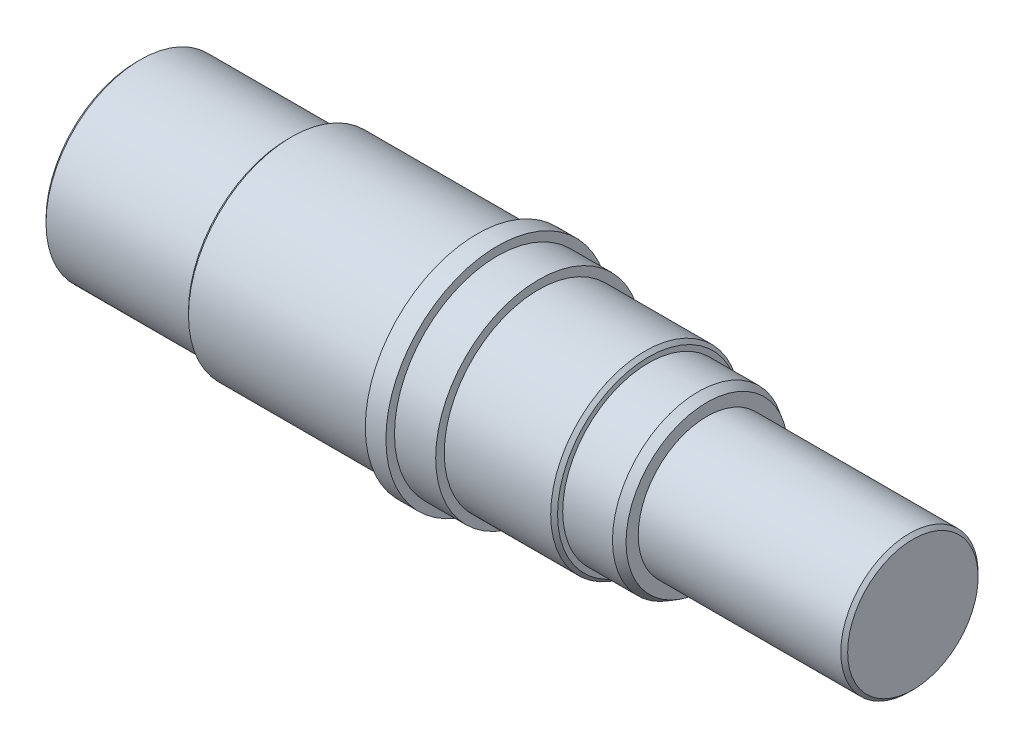
ISO-10303-21;
HEADER;
FILE_DESCRIPTION(('STEP AP214'),'2;1');
FILE_NAME('part.step','',(''),(''),'','','');
FILE_SCHEMA(('AUTOMOTIVE_DESIGN { 1 0 10303 214 1 1 1 1 }'));
ENDSEC;
DATA;
#1=APPLICATION_CONTEXT('core data for automotive mechanical design processes');
#2=APPLICATION_PROTOCOL_DEFINITION('international standard','automotive_design',2000,#1);
#3=PRODUCT_CONTEXT('',#1,'mechanical');
#4=PRODUCT('Part','Part','',(#3));
#5=PRODUCT_RELATED_PRODUCT_CATEGORY('part','',(#4));
#6=PRODUCT_DEFINITION_FORMATION('','',#4);
#7=PRODUCT_DEFINITION_CONTEXT('part definition',#1,'design');
#8=PRODUCT_DEFINITION('design','',#6,#7);
#9=PRODUCT_DEFINITION_SHAPE('','',#8);
#10=(LENGTH_UNIT() NAMED_UNIT(*) SI_UNIT(.MILLI.,.METRE.));
#11=(NAMED_UNIT(*) PLANE_ANGLE_UNIT() SI_UNIT($,.RADIAN.));
#12=(NAMED_UNIT(*) SI_UNIT($,.STERADIAN.) SOLID_ANGLE_UNIT());
#13=UNCERTAINTY_MEASURE_WITH_UNIT(LENGTH_MEASURE(1.E-05),#10,'distance_accuracy_value','');
#14=(GEOMETRIC_REPRESENTATION_CONTEXT(3) GLOBAL_UNCERTAINTY_ASSIGNED_CONTEXT((#13)) GLOBAL_UNIT_ASSIGNED_CONTEXT((#10,
#11,#12)) REPRESENTATION_CONTEXT('',''));
#15=CARTESIAN_POINT('',(0.,0.,0.));
#16=DIRECTION('',(0.,0.,1.));
#17=DIRECTION('',(1.,0.,0.));
#18=AXIS2_PLACEMENT_3D('',#15,#16,#17);
#19=CARTESIAN_POINT('',(168.152402441547,0.,0.));
#20=DIRECTION('',(1.,0.,0.));
#21=DIRECTION('',(0.,0.,-1.));
#22=AXIS2_PLACEMENT_3D('',#19,#20,#21);
#23=PLANE('',#22);
#24=CARTESIAN_POINT('',(168.152402441547,0.,0.));
#25=DIRECTION('',(-1.,0.,0.));
#26=DIRECTION('',(0.,0.,1.));
#27=AXIS2_PLACEMENT_3D('',#24,#25,#26);
#28=CIRCLE('',#27,26.5);
#29=CARTESIAN_POINT('',(168.152402441547,0.,26.5));
#30=VERTEX_POINT('',#29);
#31=EDGE_CURVE('E10',#30,#30,#28,.T.);
#32=ORIENTED_EDGE('',*,*,#31,.T.);
#33=EDGE_LOOP('',(#32));
#34=FACE_BOUND('',#33,.T.);
#35=ADVANCED_FACE('F31',(#34),#23,.F.);
#36=CARTESIAN_POINT('',(169.152402441547,0.,0.));
#37=DIRECTION('',(1.,0.,0.));
#38=DIRECTION('',(0.,0.,-1.));
#39=AXIS2_PLACEMENT_3D('',#36,#37,#38);
#40=CONICAL_SURFACE('',#39,27.5,0.78539816339745);
#41=ORIENTED_EDGE('',*,*,#31,.F.);
#42=EDGE_LOOP('',(#41));
#43=FACE_BOUND('',#42,.T.);
#44=CARTESIAN_POINT('',(169.152402441547,0.,0.));
#45=DIRECTION('',(-1.,0.,0.));
#46=DIRECTION('',(0.,0.,1.));
#47=AXIS2_PLACEMENT_3D('',#44,#45,#46);
#48=CIRCLE('',#47,27.5);
#49=CARTESIAN_POINT('',(169.152402441547,0.,27.5));
#50=VERTEX_POINT('',#49);
#51=EDGE_CURVE('E37',#50,#50,#48,.T.);
#52=ORIENTED_EDGE('',*,*,#51,.T.);
#53=EDGE_LOOP('',(#52));
#54=FACE_BOUND('',#53,.T.);
#55=ADVANCED_FACE('F108',(#43,#54),#40,.T.);
#56=CARTESIAN_POINT('',(168.152402441547,0.,0.));
#57=DIRECTION('',(-1.,0.,0.));
#58=DIRECTION('',(0.,0.,1.));
#59=AXIS2_PLACEMENT_3D('',#56,#57,#58);
#60=CYLINDRICAL_SURFACE('',#59,27.5);
#61=ORIENTED_EDGE('',*,*,#51,.F.);
#62=EDGE_LOOP('',(#61));
#63=FACE_BOUND('',#62,.T.);
#64=CARTESIAN_POINT('',(212.152402441547,0.,0.));
#65=DIRECTION('',(-1.,0.,0.));
#66=DIRECTION('',(0.,0.,1.));
#67=AXIS2_PLACEMENT_3D('',#64,#65,#66);
#68=CIRCLE('',#67,27.5);
#69=CARTESIAN_POINT('',(212.152402441547,0.,27.5));
#70=VERTEX_POINT('',#69);
#71=EDGE_CURVE('E41',#70,#70,#68,.T.);
#72=ORIENTED_EDGE('',*,*,#71,.T.);
#73=EDGE_LOOP('',(#72));
#74=FACE_BOUND('',#73,.T.);
#75=ADVANCED_FACE('F112',(#63,#74),#60,.T.);
#76=CARTESIAN_POINT('',(212.152402441547,27.5,0.));
#77=DIRECTION('',(1.,0.,0.));
#78=DIRECTION('',(0.,0.,-1.));
#79=AXIS2_PLACEMENT_3D('',#76,#77,#78);
#80=PLANE('',#79);
#81=ORIENTED_EDGE('',*,*,#71,.F.);
#82=EDGE_LOOP('',(#81));
#83=FACE_BOUND('',#82,.T.);
#84=CARTESIAN_POINT('',(212.152402441547,0.,0.));
#85=DIRECTION('',(-1.,0.,0.));
#86=DIRECTION('',(0.,0.,1.));
#87=AXIS2_PLACEMENT_3D('',#84,#85,#86);
#88=CIRCLE('',#87,29.);
#89=CARTESIAN_POINT('',(212.152402441547,0.,29.));
#90=VERTEX_POINT('',#89);
#91=EDGE_CURVE('E45',#90,#90,#88,.T.);
#92=ORIENTED_EDGE('',*,*,#91,.T.);
#93=EDGE_LOOP('',(#92));
#94=FACE_BOUND('',#93,.T.);
#95=ADVANCED_FACE('F117',(#83,#94),#80,.F.);
#96=CARTESIAN_POINT('',(213.152402441547,0.,0.));
#97=DIRECTION('',(1.,0.,0.));
#98=DIRECTION('',(0.,0.,-1.));
#99=AXIS2_PLACEMENT_3D('',#96,#97,#98);
#100=CONICAL_SURFACE('',#99,30.,0.78539816339745);
#101=ORIENTED_EDGE('',*,*,#91,.F.);
#102=EDGE_LOOP('',(#101));
#103=FACE_BOUND('',#102,.T.);
#104=CARTESIAN_POINT('',(213.152402441547,0.,0.));
#105=DIRECTION('',(-1.,0.,0.));
#106=DIRECTION('',(0.,0.,1.));
#107=AXIS2_PLACEMENT_3D('',#104,#105,#106);
#108=CIRCLE('',#107,30.);
#109=CARTESIAN_POINT('',(213.152402441547,0.,30.));
#110=VERTEX_POINT('',#109);
#111=EDGE_CURVE('E50',#110,#110,#108,.T.);
#112=ORIENTED_EDGE('',*,*,#111,.T.);
#113=EDGE_LOOP('',(#112));
#114=FACE_BOUND('',#113,.T.);
#115=ADVANCED_FACE('F123',(#103,#114),#100,.T.);
#116=CARTESIAN_POINT('',(168.152402441547,0.,0.));
#117=DIRECTION('',(-1.,0.,0.));
#118=DIRECTION('',(0.,0.,1.));
#119=AXIS2_PLACEMENT_3D('',#116,#117,#118);
#120=CYLINDRICAL_SURFACE('',#119,30.);
#121=ORIENTED_EDGE('',*,*,#111,.F.);
#122=EDGE_LOOP('',(#121));
#123=FACE_BOUND('',#122,.T.);
#124=CARTESIAN_POINT('',(267.152402441547,0.,0.));
#125=DIRECTION('',(-1.,0.,0.));
#126=DIRECTION('',(0.,0.,1.));
#127=AXIS2_PLACEMENT_3D('',#124,#125,#126);
#128=CIRCLE('',#127,30.);
#129=CARTESIAN_POINT('',(267.152402441547,0.,30.));
#130=VERTEX_POINT('',#129);
#131=EDGE_CURVE('E53',#130,#130,#128,.T.);
#132=ORIENTED_EDGE('',*,*,#131,.T.);
#133=EDGE_LOOP('',(#132));
#134=FACE_BOUND('',#133,.T.);
#135=ADVANCED_FACE('F127',(#123,#134),#120,.T.);
#136=CARTESIAN_POINT('',(267.152402441547,30.,0.));
#137=DIRECTION('',(1.,0.,0.));
#138=DIRECTION('',(0.,0.,-1.));
#139=AXIS2_PLACEMENT_3D('',#136,#137,#138);
#140=PLANE('',#139);
#141=ORIENTED_EDGE('',*,*,#131,.F.);
#142=EDGE_LOOP('',(#141));
#143=FACE_BOUND('',#142,.T.);
#144=CARTESIAN_POINT('',(267.152402441547,0.,0.));
#145=DIRECTION('',(-1.,0.,0.));
#146=DIRECTION('',(0.,0.,1.));
#147=AXIS2_PLACEMENT_3D('',#144,#145,#146);
#148=CIRCLE('',#147,32.5);
#149=CARTESIAN_POINT('',(267.152402441547,0.,32.5));
#150=VERTEX_POINT('',#149);
#151=EDGE_CURVE('E56',#150,#150,#148,.T.);
#152=ORIENTED_EDGE('',*,*,#151,.T.);
#153=EDGE_LOOP('',(#152));
#154=FACE_BOUND('',#153,.T.);
#155=ADVANCED_FACE('F131',(#143,#154),#140,.F.);
#156=CARTESIAN_POINT('',(168.152402441547,0.,0.));
#157=DIRECTION('',(-1.,0.,0.));
#158=DIRECTION('',(0.,0.,1.));
#159=AXIS2_PLACEMENT_3D('',#156,#157,#158);
#160=CYLINDRICAL_SURFACE('',#159,32.5);
#161=ORIENTED_EDGE('',*,*,#151,.F.);
#162=EDGE_LOOP('',(#161));
#163=FACE_BOUND('',#162,.T.);
#164=CARTESIAN_POINT('',(273.152402441547,0.,0.));
#165=DIRECTION('',(-1.,0.,0.));
#166=DIRECTION('',(0.,0.,1.));
#167=AXIS2_PLACEMENT_3D('',#164,#165,#166);
#168=CIRCLE('',#167,32.5);
#169=CARTESIAN_POINT('',(273.152402441547,0.,32.5));
#170=VERTEX_POINT('',#169);
#171=EDGE_CURVE('E59',#170,#170,#168,.T.);
#172=ORIENTED_EDGE('',*,*,#171,.T.);
#173=EDGE_LOOP('',(#172));
#174=FACE_BOUND('',#173,.T.);
#175=ADVANCED_FACE('F135',(#163,#174),#160,.T.);
#176=CARTESIAN_POINT('',(273.152402441547,32.5,0.));
#177=DIRECTION('',(-1.,0.,0.));
#178=DIRECTION('',(0.,0.,1.));
#179=AXIS2_PLACEMENT_3D('',#176,#177,#178);
#180=PLANE('',#179);
#181=ORIENTED_EDGE('',*,*,#171,.F.);
#182=EDGE_LOOP('',(#181));
#183=FACE_BOUND('',#182,.T.);
#184=CARTESIAN_POINT('',(273.152402441547,0.,0.));
#185=DIRECTION('',(-1.,0.,0.));
#186=DIRECTION('',(0.,0.,1.));
#187=AXIS2_PLACEMENT_3D('',#184,#185,#186);
#188=CIRCLE('',#187,30.);
#189=CARTESIAN_POINT('',(273.152402441547,0.,30.));
#190=VERTEX_POINT('',#189);
#191=EDGE_CURVE('E62',#190,#190,#188,.T.);
#192=ORIENTED_EDGE('',*,*,#191,.T.);
#193=EDGE_LOOP('',(#192));
#194=FACE_BOUND('',#193,.T.);
#195=ADVANCED_FACE('F139',(#183,#194),#180,.F.);
#196=CARTESIAN_POINT('',(168.152402441547,0.,0.));
#197=DIRECTION('',(-1.,0.,0.));
#198=DIRECTION('',(0.,0.,1.));
#199=AXIS2_PLACEMENT_3D('',#196,#197,#198);
#200=CYLINDRICAL_SURFACE('',#199,30.);
#201=ORIENTED_EDGE('',*,*,#191,.F.);
#202=EDGE_LOOP('',(#201));
#203=FACE_BOUND('',#202,.T.);
#204=CARTESIAN_POINT('',(285.152402441547,0.,0.));
#205=DIRECTION('',(-1.,0.,0.));
#206=DIRECTION('',(0.,0.,1.));
#207=AXIS2_PLACEMENT_3D('',#204,#205,#206);
#208=CIRCLE('',#207,30.);
#209=CARTESIAN_POINT('',(285.152402441547,0.,30.));
#210=VERTEX_POINT('',#209);
#211=EDGE_CURVE('E65',#210,#210,#208,.T.);
#212=ORIENTED_EDGE('',*,*,#211,.T.);
#213=EDGE_LOOP('',(#212));
#214=FACE_BOUND('',#213,.T.);
#215=ADVANCED_FACE('F143',(#203,#214),#200,.T.);
#216=CARTESIAN_POINT('',(285.152402441547,30.,0.));
#217=DIRECTION('',(-1.,0.,0.));
#218=DIRECTION('',(0.,0.,1.));
#219=AXIS2_PLACEMENT_3D('',#216,#217,#218);
#220=PLANE('',#219);
#221=ORIENTED_EDGE('',*,*,#211,.F.);
#222=EDGE_LOOP('',(#221));
#223=FACE_BOUND('',#222,.T.);
#224=CARTESIAN_POINT('',(285.152402441547,0.,0.));
#225=DIRECTION('',(-1.,0.,0.));
#226=DIRECTION('',(0.,0.,1.));
#227=AXIS2_PLACEMENT_3D('',#224,#225,#226);
#228=CIRCLE('',#227,27.5);
#229=CARTESIAN_POINT('',(285.152402441547,0.,27.5));
#230=VERTEX_POINT('',#229);
#231=EDGE_CURVE('E68',#230,#230,#228,.T.);
#232=ORIENTED_EDGE('',*,*,#231,.T.);
#233=EDGE_LOOP('',(#232));
#234=FACE_BOUND('',#233,.T.);
#235=ADVANCED_FACE('F147',(#223,#234),#220,.F.);
#236=CARTESIAN_POINT('',(168.152402441547,0.,0.));
#237=DIRECTION('',(-1.,0.,0.));
#238=DIRECTION('',(0.,0.,1.));
#239=AXIS2_PLACEMENT_3D('',#236,#237,#238);
#240=CYLINDRICAL_SURFACE('',#239,27.5);
#241=ORIENTED_EDGE('',*,*,#231,.F.);
#242=EDGE_LOOP('',(#241));
#243=FACE_BOUND('',#242,.T.);
#244=CARTESIAN_POINT('',(316.152402441547,0.,0.));
#245=DIRECTION('',(-1.,0.,0.));
#246=DIRECTION('',(0.,0.,1.));
#247=AXIS2_PLACEMENT_3D('',#244,#245,#246);
#248=CIRCLE('',#247,27.5);
#249=CARTESIAN_POINT('',(316.152402441547,0.,27.5));
#250=VERTEX_POINT('',#249);
#251=EDGE_CURVE('E71',#250,#250,#248,.T.);
#252=ORIENTED_EDGE('',*,*,#251,.T.);
#253=EDGE_LOOP('',(#252));
#254=FACE_BOUND('',#253,.T.);
#255=ADVANCED_FACE('F151',(#243,#254),#240,.T.);
#256=CARTESIAN_POINT('',(317.152402441547,0.,0.));
#257=DIRECTION('',(-1.,0.,0.));
#258=DIRECTION('',(0.,0.,1.));
#259=AXIS2_PLACEMENT_3D('',#256,#257,#258);
#260=CONICAL_SURFACE('',#259,26.5,0.785398163397448);
#261=ORIENTED_EDGE('',*,*,#251,.F.);
#262=EDGE_LOOP('',(#261));
#263=FACE_BOUND('',#262,.T.);
#264=CARTESIAN_POINT('',(317.152402441547,0.,0.));
#265=DIRECTION('',(-1.,0.,0.));
#266=DIRECTION('',(0.,0.,1.));
#267=AXIS2_PLACEMENT_3D('',#264,#265,#266);
#268=CIRCLE('',#267,26.5);
#269=CARTESIAN_POINT('',(317.152402441547,0.,26.5));
#270=VERTEX_POINT('',#269);
#271=EDGE_CURVE('E74',#270,#270,#268,.T.);
#272=ORIENTED_EDGE('',*,*,#271,.T.);
#273=EDGE_LOOP('',(#272));
#274=FACE_BOUND('',#273,.T.);
#275=ADVANCED_FACE('F155',(#263,#274),#260,.T.);
#276=CARTESIAN_POINT('',(317.152402441547,26.5,0.));
#277=DIRECTION('',(-1.,0.,0.));
#278=DIRECTION('',(0.,0.,1.));
#279=AXIS2_PLACEMENT_3D('',#276,#277,#278);
#280=PLANE('',#279);
#281=ORIENTED_EDGE('',*,*,#271,.F.);
#282=EDGE_LOOP('',(#281));
#283=FACE_BOUND('',#282,.T.);
#284=CARTESIAN_POINT('',(317.152402441547,0.,0.));
#285=DIRECTION('',(-1.,0.,0.));
#286=DIRECTION('',(0.,0.,1.));
#287=AXIS2_PLACEMENT_3D('',#284,#285,#286);
#288=CIRCLE('',#287,25.);
#289=CARTESIAN_POINT('',(317.152402441547,0.,25.));
#290=VERTEX_POINT('',#289);
#291=EDGE_CURVE('E77',#290,#290,#288,.T.);
#292=ORIENTED_EDGE('',*,*,#291,.T.);
#293=EDGE_LOOP('',(#292));
#294=FACE_BOUND('',#293,.T.);
#295=ADVANCED_FACE('F159',(#283,#294),#280,.F.);
#296=CARTESIAN_POINT('',(168.152402441547,0.,0.));
#297=DIRECTION('',(-1.,0.,0.));
#298=DIRECTION('',(0.,0.,1.));
#299=AXIS2_PLACEMENT_3D('',#296,#297,#298);
#300=CYLINDRICAL_SURFACE('',#299,25.);
#301=ORIENTED_EDGE('',*,*,#291,.F.);
#302=EDGE_LOOP('',(#301));
#303=FACE_BOUND('',#302,.T.);
#304=CARTESIAN_POINT('',(331.652402441547,0.,0.));
#305=DIRECTION('',(-1.,0.,0.));
#306=DIRECTION('',(0.,0.,1.));
#307=AXIS2_PLACEMENT_3D('',#304,#305,#306);
#308=CIRCLE('',#307,25.);
#309=CARTESIAN_POINT('',(331.652402441547,0.,25.));
#310=VERTEX_POINT('',#309);
#311=EDGE_CURVE('E80',#310,#310,#308,.T.);
#312=ORIENTED_EDGE('',*,*,#311,.T.);
#313=EDGE_LOOP('',(#312));
#314=FACE_BOUND('',#313,.T.);
#315=ADVANCED_FACE('F163',(#303,#314),#300,.T.);
#316=CARTESIAN_POINT('',(334.152402441547,0.,0.));
#317=DIRECTION('',(-1.,0.,0.));
#318=DIRECTION('',(0.,0.,1.));
#319=AXIS2_PLACEMENT_3D('',#316,#317,#318);
#320=CONICAL_SURFACE('',#319,23.5566243270259,0.52359877559832);
#321=ORIENTED_EDGE('',*,*,#311,.F.);
#322=EDGE_LOOP('',(#321));
#323=FACE_BOUND('',#322,.T.);
#324=CARTESIAN_POINT('',(334.152402441547,0.,0.));
#325=DIRECTION('',(-1.,0.,0.));
#326=DIRECTION('',(0.,0.,1.));
#327=AXIS2_PLACEMENT_3D('',#324,#325,#326);
#328=CIRCLE('',#327,23.5566243270259);
#329=CARTESIAN_POINT('',(334.152402441547,0.,23.5566243270259));
#330=VERTEX_POINT('',#329);
#331=EDGE_CURVE('E83',#330,#330,#328,.T.);
#332=ORIENTED_EDGE('',*,*,#331,.T.);
#333=EDGE_LOOP('',(#332));
#334=FACE_BOUND('',#333,.T.);
#335=ADVANCED_FACE('F167',(#323,#334),#320,.T.);
#336=CARTESIAN_POINT('',(334.152402441547,23.5566243270259,0.));
#337=DIRECTION('',(-1.,0.,0.));
#338=DIRECTION('',(0.,0.,1.));
#339=AXIS2_PLACEMENT_3D('',#336,#337,#338);
#340=PLANE('',#339);
#341=ORIENTED_EDGE('',*,*,#331,.F.);
#342=EDGE_LOOP('',(#341));
#343=FACE_BOUND('',#342,.T.);
#344=CARTESIAN_POINT('',(334.152402441547,0.,0.));
#345=DIRECTION('',(-1.,0.,0.));
#346=DIRECTION('',(0.,0.,1.));
#347=AXIS2_PLACEMENT_3D('',#344,#345,#346);
#348=CIRCLE('',#347,20.);
#349=CARTESIAN_POINT('',(334.152402441547,0.,20.));
#350=VERTEX_POINT('',#349);
#351=EDGE_CURVE('E86',#350,#350,#348,.T.);
#352=ORIENTED_EDGE('',*,*,#351,.T.);
#353=EDGE_LOOP('',(#352));
#354=FACE_BOUND('',#353,.T.);
#355=ADVANCED_FACE('F171',(#343,#354),#340,.F.);
#356=CARTESIAN_POINT('',(168.152402441547,0.,0.));
#357=DIRECTION('',(-1.,0.,0.));
#358=DIRECTION('',(0.,0.,1.));
#359=AXIS2_PLACEMENT_3D('',#356,#357,#358);
#360=CYLINDRICAL_SURFACE('',#359,20.);
#361=ORIENTED_EDGE('',*,*,#351,.F.);
#362=EDGE_LOOP('',(#361));
#363=FACE_BOUND('',#362,.T.);
#364=CARTESIAN_POINT('',(393.152402441547,0.,0.));
#365=DIRECTION('',(-1.,0.,0.));
#366=DIRECTION('',(0.,0.,1.));
#367=AXIS2_PLACEMENT_3D('',#364,#365,#366);
#368=CIRCLE('',#367,20.);
#369=CARTESIAN_POINT('',(393.152402441547,0.,20.));
#370=VERTEX_POINT('',#369);
#371=EDGE_CURVE('E89',#370,#370,#368,.T.);
#372=ORIENTED_EDGE('',*,*,#371,.T.);
#373=EDGE_LOOP('',(#372));
#374=FACE_BOUND('',#373,.T.);
#375=ADVANCED_FACE('F104',(#363,#374),#360,.T.);
#376=CARTESIAN_POINT('',(394.152402441547,0.,0.));
#377=DIRECTION('',(-1.,0.,0.));
#378=DIRECTION('',(0.,0.,1.));
#379=AXIS2_PLACEMENT_3D('',#376,#377,#378);
#380=CONICAL_SURFACE('',#379,19.,0.785398163397445);
#381=ORIENTED_EDGE('',*,*,#371,.F.);
#382=EDGE_LOOP('',(#381));
#383=FACE_BOUND('',#382,.T.);
#384=CARTESIAN_POINT('',(394.152402441547,0.,0.));
#385=DIRECTION('',(-1.,0.,0.));
#386=DIRECTION('',(0.,0.,1.));
#387=AXIS2_PLACEMENT_3D('',#384,#385,#386);
#388=CIRCLE('',#387,19.);
#389=CARTESIAN_POINT('',(394.152402441547,0.,19.));
#390=VERTEX_POINT('',#389);
#391=EDGE_CURVE('E92',#390,#390,#388,.T.);
#392=ORIENTED_EDGE('',*,*,#391,.T.);
#393=EDGE_LOOP('',(#392));
#394=FACE_BOUND('',#393,.T.);
#395=ADVANCED_FACE('F96',(#383,#394),#380,.T.);
#396=CARTESIAN_POINT('',(394.152402441547,19.,0.));
#397=DIRECTION('',(-1.,0.,0.));
#398=DIRECTION('',(0.,0.,1.));
#399=AXIS2_PLACEMENT_3D('',#396,#397,#398);
#400=PLANE('',#399);
#401=ORIENTED_EDGE('',*,*,#391,.F.);
#402=EDGE_LOOP('',(#401));
#403=FACE_BOUND('',#402,.T.);
#404=ADVANCED_FACE('F98',(#403),#400,.F.);
#405=CLOSED_SHELL('',(#35,#55,#75,#95,#115,#135,#155,#175,#195,#215,#235,#255,#275,#295,#315,
#335,#355,#375,#395,#404));
#406=MANIFOLD_SOLID_BREP('B2',#405);
#407=ADVANCED_BREP_SHAPE_REPRESENTATION('',(#18,#406),#14);
#408=SHAPE_DEFINITION_REPRESENTATION(#9,#407);
ENDSEC;
END-ISO-10303-21;
